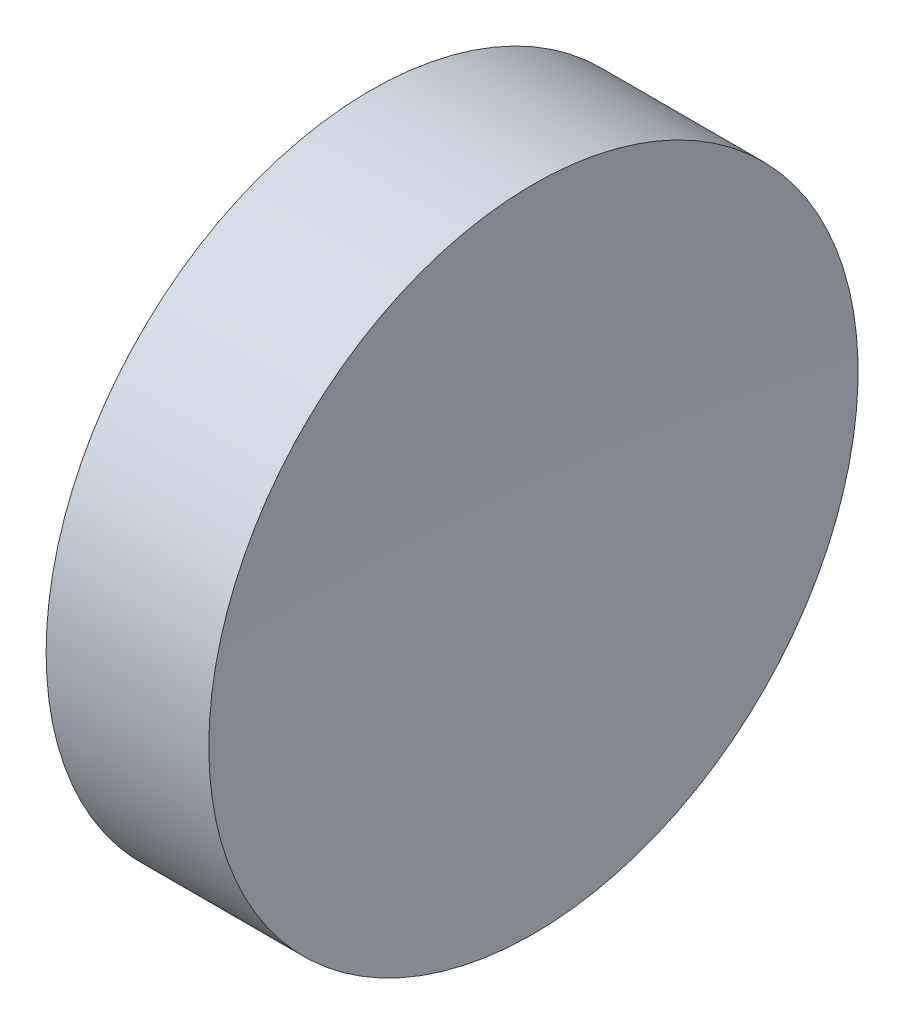
ISO-10303-21;
HEADER;
FILE_DESCRIPTION(('STEP AP214'),'2;1');
FILE_NAME('part.step','',(''),(''),'','','');
FILE_SCHEMA(('AUTOMOTIVE_DESIGN { 1 0 10303 214 1 1 1 1 }'));
ENDSEC;
DATA;
#1=APPLICATION_CONTEXT('core data for automotive mechanical design processes');
#2=APPLICATION_PROTOCOL_DEFINITION('international standard','automotive_design',2000,#1);
#3=PRODUCT_CONTEXT('',#1,'mechanical');
#4=PRODUCT('Part','Part','',(#3));
#5=PRODUCT_RELATED_PRODUCT_CATEGORY('part','',(#4));
#6=PRODUCT_DEFINITION_FORMATION('','',#4);
#7=PRODUCT_DEFINITION_CONTEXT('part definition',#1,'design');
#8=PRODUCT_DEFINITION('design','',#6,#7);
#9=PRODUCT_DEFINITION_SHAPE('','',#8);
#10=(LENGTH_UNIT() NAMED_UNIT(*) SI_UNIT(.MILLI.,.METRE.));
#11=(NAMED_UNIT(*) PLANE_ANGLE_UNIT() SI_UNIT($,.RADIAN.));
#12=(NAMED_UNIT(*) SI_UNIT($,.STERADIAN.) SOLID_ANGLE_UNIT());
#13=UNCERTAINTY_MEASURE_WITH_UNIT(LENGTH_MEASURE(1.E-05),#10,'distance_accuracy_value','');
#14=(GEOMETRIC_REPRESENTATION_CONTEXT(3) GLOBAL_UNCERTAINTY_ASSIGNED_CONTEXT((#13)) GLOBAL_UNIT_ASSIGNED_CONTEXT((#10,
#11,#12)) REPRESENTATION_CONTEXT('',''));
#15=CARTESIAN_POINT('',(0.,0.,0.));
#16=DIRECTION('',(0.,0.,1.));
#17=DIRECTION('',(1.,0.,0.));
#18=AXIS2_PLACEMENT_3D('',#15,#16,#17);
#19=CARTESIAN_POINT('',(0.,0.,0.));
#20=DIRECTION('',(1.,0.,0.));
#21=DIRECTION('',(0.,0.,-1.));
#22=AXIS2_PLACEMENT_3D('',#19,#20,#21);
#23=PLANE('',#22);
#24=CARTESIAN_POINT('',(0.,0.,0.));
#25=DIRECTION('',(-1.,0.,0.));
#26=DIRECTION('',(0.,0.,1.));
#27=AXIS2_PLACEMENT_3D('',#24,#25,#26);
#28=CIRCLE('',#27,6.35);
#29=CARTESIAN_POINT('',(0.,0.,6.35));
#30=VERTEX_POINT('',#29);
#31=EDGE_CURVE('E39',#30,#30,#28,.T.);
#32=ORIENTED_EDGE('',*,*,#31,.T.);
#33=EDGE_LOOP('',(#32));
#34=FACE_BOUND('',#33,.T.);
#35=ADVANCED_FACE('F33',(#34),#23,.F.);
#36=CARTESIAN_POINT('',(102.98,0.,0.));
#37=DIRECTION('',(-1.,0.,0.));
#38=DIRECTION('',(0.,0.,1.));
#39=AXIS2_PLACEMENT_3D('',#36,#37,#38);
#40=SPHERICAL_SURFACE('',#39,100.);
#41=CARTESIAN_POINT('',(3.18181614878955,0.,0.));
#42=DIRECTION('',(-1.,0.,0.));
#43=DIRECTION('',(0.,0.,1.));
#44=AXIS2_PLACEMENT_3D('',#41,#42,#43);
#45=CIRCLE('',#44,6.35);
#46=CARTESIAN_POINT('',(3.18181614878955,0.,6.35));
#47=VERTEX_POINT('',#46);
#48=EDGE_CURVE('E10',#47,#47,#45,.T.);
#49=ORIENTED_EDGE('',*,*,#48,.F.);
#50=EDGE_LOOP('',(#49));
#51=FACE_BOUND('',#50,.T.);
#52=ADVANCED_FACE('F48',(#51),#40,.F.);
#53=CARTESIAN_POINT('',(0.,0.,0.));
#54=DIRECTION('',(-1.,0.,0.));
#55=DIRECTION('',(0.,0.,1.));
#56=AXIS2_PLACEMENT_3D('',#53,#54,#55);
#57=CYLINDRICAL_SURFACE('',#56,6.35);
#58=ORIENTED_EDGE('',*,*,#31,.F.);
#59=EDGE_LOOP('',(#58));
#60=FACE_BOUND('',#59,.T.);
#61=ORIENTED_EDGE('',*,*,#48,.T.);
#62=EDGE_LOOP('',(#61));
#63=FACE_BOUND('',#62,.T.);
#64=ADVANCED_FACE('F46',(#60,#63),#57,.T.);
#65=CLOSED_SHELL('',(#35,#52,#64));
#66=MANIFOLD_SOLID_BREP('B2',#65);
#67=ADVANCED_BREP_SHAPE_REPRESENTATION('',(#18,#66),#14);
#68=SHAPE_DEFINITION_REPRESENTATION(#9,#67);
ENDSEC;
END-ISO-10303-21;
